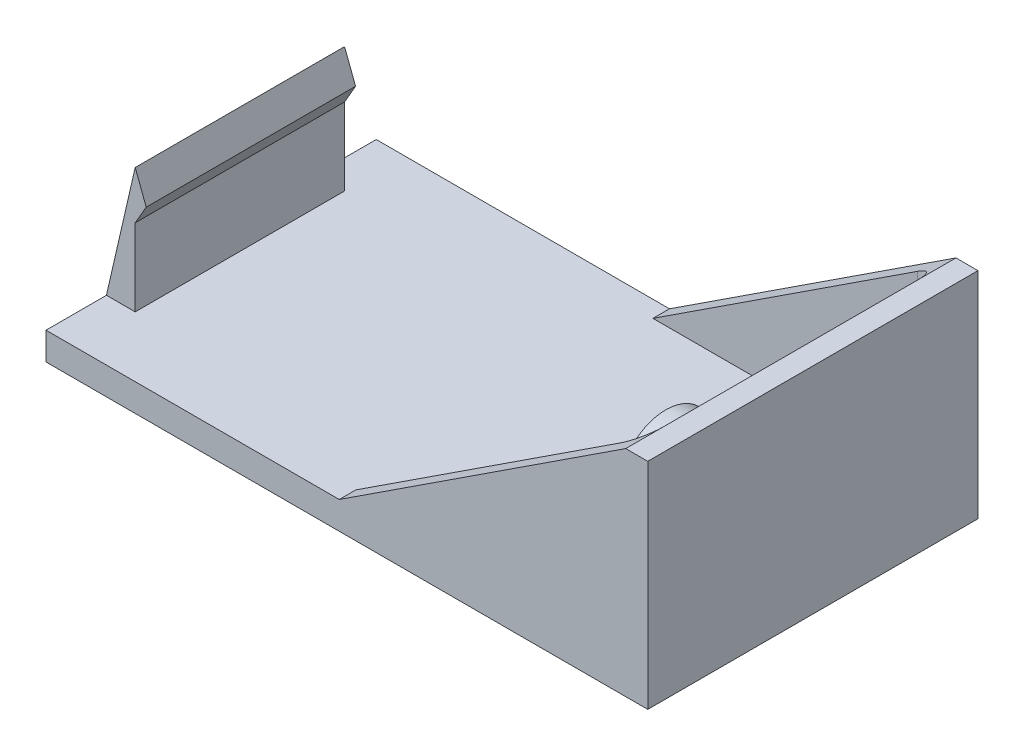
ISO-10303-21;
HEADER;
FILE_DESCRIPTION(('STEP AP214'),'2;1');
FILE_NAME('part.step','',(''),(''),'','','');
FILE_SCHEMA(('AUTOMOTIVE_DESIGN { 1 0 10303 214 1 1 1 1 }'));
ENDSEC;
DATA;
#1=APPLICATION_CONTEXT('core data for automotive mechanical design processes');
#2=APPLICATION_PROTOCOL_DEFINITION('international standard','automotive_design',2000,#1);
#3=PRODUCT_CONTEXT('',#1,'mechanical');
#4=PRODUCT('Part','Part','',(#3));
#5=PRODUCT_RELATED_PRODUCT_CATEGORY('part','',(#4));
#6=PRODUCT_DEFINITION_FORMATION('','',#4);
#7=PRODUCT_DEFINITION_CONTEXT('part definition',#1,'design');
#8=PRODUCT_DEFINITION('design','',#6,#7);
#9=PRODUCT_DEFINITION_SHAPE('','',#8);
#10=(LENGTH_UNIT() NAMED_UNIT(*) SI_UNIT(.MILLI.,.METRE.));
#11=(NAMED_UNIT(*) PLANE_ANGLE_UNIT() SI_UNIT($,.RADIAN.));
#12=(NAMED_UNIT(*) SI_UNIT($,.STERADIAN.) SOLID_ANGLE_UNIT());
#13=UNCERTAINTY_MEASURE_WITH_UNIT(LENGTH_MEASURE(1.E-05),#10,'distance_accuracy_value','');
#14=(GEOMETRIC_REPRESENTATION_CONTEXT(3) GLOBAL_UNCERTAINTY_ASSIGNED_CONTEXT((#13)) GLOBAL_UNIT_ASSIGNED_CONTEXT((#10,
#11,#12)) REPRESENTATION_CONTEXT('',''));
#15=CARTESIAN_POINT('',(0.,0.,0.));
#16=DIRECTION('',(0.,0.,1.));
#17=DIRECTION('',(1.,0.,0.));
#18=AXIS2_PLACEMENT_3D('',#15,#16,#17);
#19=CARTESIAN_POINT('',(24.305,11.48,-6.34999999999999));
#20=DIRECTION('',(-1.,0.,0.));
#21=DIRECTION('',(0.,0.,1.));
#22=AXIS2_PLACEMENT_3D('',#19,#20,#21);
#23=PLANE('',#22);
#24=CARTESIAN_POINT('',(24.305,11.48,-6.34999999999999));
#25=DIRECTION('',(-1.,0.,0.));
#26=DIRECTION('',(0.,0.,1.));
#27=AXIS2_PLACEMENT_3D('',#24,#25,#26);
#28=CIRCLE('',#27,3.75);
#29=CARTESIAN_POINT('',(24.305,11.48,-2.59999999999999));
#30=VERTEX_POINT('',#29);
#31=EDGE_CURVE('E165',#30,#30,#28,.T.);
#32=ORIENTED_EDGE('',*,*,#31,.T.);
#33=EDGE_LOOP('',(#32));
#34=FACE_BOUND('',#33,.T.);
#35=CARTESIAN_POINT('',(24.305,11.48,-6.34999999999999));
#36=DIRECTION('',(-1.,0.,0.));
#37=DIRECTION('',(0.,0.,1.));
#38=AXIS2_PLACEMENT_3D('',#35,#36,#37);
#39=CIRCLE('',#38,3.);
#40=CARTESIAN_POINT('',(24.305,11.48,-3.34999999999999));
#41=VERTEX_POINT('',#40);
#42=EDGE_CURVE('E295',#41,#41,#39,.T.);
#43=ORIENTED_EDGE('',*,*,#42,.F.);
#44=EDGE_LOOP('',(#43));
#45=FACE_BOUND('',#44,.T.);
#46=ADVANCED_FACE('F33',(#34,#45),#23,.T.);
#47=CARTESIAN_POINT('',(25.305,19.5,11.485));
#48=DIRECTION('',(1.,0.,0.));
#49=DIRECTION('',(0.,0.,-1.));
#50=AXIS2_PLACEMENT_3D('',#47,#48,#49);
#51=PLANE('',#50);
#52=DIRECTION('',(0.,0.,1.));
#53=VECTOR('',#52,1.);
#54=CARTESIAN_POINT('',(25.305,2.5,11.485));
#55=LINE('',#54,#53);
#56=CARTESIAN_POINT('',(25.305,2.5,-11.485));
#57=VERTEX_POINT('',#56);
#58=CARTESIAN_POINT('',(25.305,2.5,11.485));
#59=VERTEX_POINT('',#58);
#60=EDGE_CURVE('E233',#57,#59,#55,.T.);
#61=ORIENTED_EDGE('',*,*,#60,.T.);
#62=DIRECTION('',(0.,-1.,0.));
#63=VECTOR('',#62,1.);
#64=CARTESIAN_POINT('',(25.305,19.5,11.485));
#65=LINE('',#64,#63);
#66=CARTESIAN_POINT('',(25.305,19.5,11.485));
#67=VERTEX_POINT('',#66);
#68=EDGE_CURVE('E667',#67,#59,#65,.T.);
#69=ORIENTED_EDGE('',*,*,#68,.F.);
#70=DIRECTION('',(0.,0.,1.));
#71=VECTOR('',#70,1.);
#72=CARTESIAN_POINT('',(25.305,19.5,11.485));
#73=LINE('',#72,#71);
#74=CARTESIAN_POINT('',(25.305,19.5,-11.485));
#75=VERTEX_POINT('',#74);
#76=EDGE_CURVE('E221',#75,#67,#73,.T.);
#77=ORIENTED_EDGE('',*,*,#76,.F.);
#78=DIRECTION('',(0.,-1.,0.));
#79=VECTOR('',#78,1.);
#80=CARTESIAN_POINT('',(25.305,19.5,-11.485));
#81=LINE('',#80,#79);
#82=EDGE_CURVE('E669',#75,#57,#81,.T.);
#83=ORIENTED_EDGE('',*,*,#82,.T.);
#84=EDGE_LOOP('',(#61,#69,#77,#83));
#85=FACE_BOUND('',#84,.T.);
#86=CARTESIAN_POINT('',(25.305,11.48,-6.34999999999999));
#87=DIRECTION('',(1.,0.,0.));
#88=DIRECTION('',(0.,0.,-1.));
#89=AXIS2_PLACEMENT_3D('',#86,#87,#88);
#90=CIRCLE('',#89,3.75);
#91=CARTESIAN_POINT('',(25.305,11.48,-10.1));
#92=VERTEX_POINT('',#91);
#93=EDGE_CURVE('E257',#92,#92,#90,.F.);
#94=ORIENTED_EDGE('',*,*,#93,.F.);
#95=EDGE_LOOP('',(#94));
#96=FACE_BOUND('',#95,.T.);
#97=CARTESIAN_POINT('',(25.305,11.48,6.35000000000001));
#98=DIRECTION('',(1.,0.,0.));
#99=DIRECTION('',(0.,0.,-1.));
#100=AXIS2_PLACEMENT_3D('',#97,#98,#99);
#101=CIRCLE('',#100,3.75);
#102=CARTESIAN_POINT('',(25.305,11.48,2.60000000000001));
#103=VERTEX_POINT('',#102);
#104=EDGE_CURVE('E260',#103,#103,#101,.F.);
#105=ORIENTED_EDGE('',*,*,#104,.F.);
#106=EDGE_LOOP('',(#105));
#107=FACE_BOUND('',#106,.T.);
#108=ADVANCED_FACE('F284',(#85,#96,#107),#51,.F.);
#109=CARTESIAN_POINT('',(0.,2.5,0.));
#110=DIRECTION('',(0.,1.,0.));
#111=DIRECTION('',(0.,0.,1.));
#112=AXIS2_PLACEMENT_3D('',#109,#110,#111);
#113=PLANE('',#112);
#114=DIRECTION('',(0.,0.,1.));
#115=VECTOR('',#114,1.);
#116=CARTESIAN_POINT('',(-27.305,2.5,-14.985));
#117=LINE('',#116,#115);
#118=CARTESIAN_POINT('',(-27.305,2.5,-14.985));
#119=VERTEX_POINT('',#118);
#120=CARTESIAN_POINT('',(-27.305,2.5,-9.5));
#121=VERTEX_POINT('',#120);
#122=EDGE_CURVE('E655',#119,#121,#117,.T.);
#123=ORIENTED_EDGE('',*,*,#122,.T.);
#124=DIRECTION('',(1.,0.,0.));
#125=VECTOR('',#124,1.);
#126=CARTESIAN_POINT('',(-24.695,2.5,-9.5));
#127=LINE('',#126,#125);
#128=CARTESIAN_POINT('',(-24.695,2.5,-9.5));
#129=VERTEX_POINT('',#128);
#130=EDGE_CURVE('E48',#121,#129,#127,.T.);
#131=ORIENTED_EDGE('',*,*,#130,.T.);
#132=DIRECTION('',(0.,0.,1.));
#133=VECTOR('',#132,1.);
#134=CARTESIAN_POINT('',(-24.695,2.5,-9.5));
#135=LINE('',#134,#133);
#136=CARTESIAN_POINT('',(-24.695,2.5,9.5));
#137=VERTEX_POINT('',#136);
#138=EDGE_CURVE('E143',#129,#137,#135,.T.);
#139=ORIENTED_EDGE('',*,*,#138,.T.);
#140=DIRECTION('',(1.,0.,0.));
#141=VECTOR('',#140,1.);
#142=CARTESIAN_POINT('',(-24.695,2.5,9.5));
#143=LINE('',#142,#141);
#144=CARTESIAN_POINT('',(-27.305,2.5,9.49999999999999));
#145=VERTEX_POINT('',#144);
#146=EDGE_CURVE('E54',#145,#137,#143,.T.);
#147=ORIENTED_EDGE('',*,*,#146,.F.);
#148=CARTESIAN_POINT('',(-27.305,2.5,14.985));
#149=VERTEX_POINT('',#148);
#150=EDGE_CURVE('E640',#145,#149,#117,.T.);
#151=ORIENTED_EDGE('',*,*,#150,.T.);
#152=DIRECTION('',(1.,0.,0.));
#153=VECTOR('',#152,1.);
#154=CARTESIAN_POINT('',(-27.305,2.5,14.985));
#155=LINE('',#154,#153);
#156=CARTESIAN_POINT('',(-0.694999999999994,2.5,14.985));
#157=VERTEX_POINT('',#156);
#158=EDGE_CURVE('E632',#149,#157,#155,.T.);
#159=ORIENTED_EDGE('',*,*,#158,.T.);
#160=DIRECTION('',(0.,0.,1.));
#161=VECTOR('',#160,1.);
#162=CARTESIAN_POINT('',(-0.694999999999994,2.5,14.985));
#163=LINE('',#162,#161);
#164=CARTESIAN_POINT('',(-0.694999999999994,2.5,13.485));
#165=VERTEX_POINT('',#164);
#166=EDGE_CURVE('E218',#165,#157,#163,.T.);
#167=ORIENTED_EDGE('',*,*,#166,.F.);
#168=DIRECTION('',(-1.,0.,0.));
#169=VECTOR('',#168,1.);
#170=CARTESIAN_POINT('',(-0.694999999999994,2.5,13.485));
#171=LINE('',#170,#169);
#172=CARTESIAN_POINT('',(23.305,2.5,13.485));
#173=VERTEX_POINT('',#172);
#174=EDGE_CURVE('E239',#173,#165,#171,.T.);
#175=ORIENTED_EDGE('',*,*,#174,.F.);
#176=CARTESIAN_POINT('',(23.305,2.5,11.485));
#177=DIRECTION('',(0.,-1.,0.));
#178=DIRECTION('',(0.,0.,-1.));
#179=AXIS2_PLACEMENT_3D('',#176,#177,#178);
#180=CIRCLE('',#179,2.);
#181=EDGE_CURVE('E236',#59,#173,#180,.T.);
#182=ORIENTED_EDGE('',*,*,#181,.F.);
#183=ORIENTED_EDGE('',*,*,#60,.F.);
#184=CARTESIAN_POINT('',(23.305,2.5,-11.485));
#185=DIRECTION('',(0.,-1.,0.));
#186=DIRECTION('',(0.,0.,1.));
#187=AXIS2_PLACEMENT_3D('',#184,#185,#186);
#188=CIRCLE('',#187,2.);
#189=CARTESIAN_POINT('',(23.305,2.5,-13.485));
#190=VERTEX_POINT('',#189);
#191=EDGE_CURVE('E230',#190,#57,#188,.T.);
#192=ORIENTED_EDGE('',*,*,#191,.F.);
#193=DIRECTION('',(1.,0.,0.));
#194=VECTOR('',#193,1.);
#195=CARTESIAN_POINT('',(-0.694999999999967,2.5,-13.485));
#196=LINE('',#195,#194);
#197=CARTESIAN_POINT('',(-0.694999999999994,2.5,-13.485));
#198=VERTEX_POINT('',#197);
#199=EDGE_CURVE('E227',#198,#190,#196,.T.);
#200=ORIENTED_EDGE('',*,*,#199,.F.);
#201=DIRECTION('',(0.,0.,1.));
#202=VECTOR('',#201,1.);
#203=CARTESIAN_POINT('',(-0.694999999999967,2.5,-14.985));
#204=LINE('',#203,#202);
#205=CARTESIAN_POINT('',(-0.694999999999994,2.5,-14.9850225));
#206=VERTEX_POINT('',#205);
#207=EDGE_CURVE('E211',#206,#198,#204,.T.);
#208=ORIENTED_EDGE('',*,*,#207,.F.);
#209=DIRECTION('',(-1.,0.,0.));
#210=VECTOR('',#209,1.);
#211=CARTESIAN_POINT('',(-27.305,2.5,-14.985));
#212=LINE('',#211,#210);
#213=EDGE_CURVE('E638',#206,#119,#212,.T.);
#214=ORIENTED_EDGE('',*,*,#213,.T.);
#215=EDGE_LOOP('',(#123,#131,#139,#147,#151,#159,#167,#175,#182,#183,#192,#200,#208,#214));
#216=FACE_BOUND('',#215,.T.);
#217=ADVANCED_FACE('F145',(#216),#113,.T.);
#218=CARTESIAN_POINT('',(27.305,2.5,-14.985));
#219=DIRECTION('',(-1.,0.,0.));
#220=DIRECTION('',(0.,0.,1.));
#221=AXIS2_PLACEMENT_3D('',#218,#219,#220);
#222=PLANE('',#221);
#223=DIRECTION('',(0.,0.,-1.));
#224=VECTOR('',#223,1.);
#225=CARTESIAN_POINT('',(27.305,0.,-14.985));
#226=LINE('',#225,#224);
#227=CARTESIAN_POINT('',(27.305,0.,14.985));
#228=VERTEX_POINT('',#227);
#229=CARTESIAN_POINT('',(27.305,0.,-14.985));
#230=VERTEX_POINT('',#229);
#231=EDGE_CURVE('E637',#228,#230,#226,.T.);
#232=ORIENTED_EDGE('',*,*,#231,.T.);
#233=DIRECTION('',(0.,-1.,0.));
#234=VECTOR('',#233,1.);
#235=CARTESIAN_POINT('',(27.305,2.5,-14.985));
#236=LINE('',#235,#234);
#237=CARTESIAN_POINT('',(27.305,19.5,-14.985));
#238=VERTEX_POINT('',#237);
#239=EDGE_CURVE('E253',#238,#230,#236,.T.);
#240=ORIENTED_EDGE('',*,*,#239,.F.);
#241=DIRECTION('',(0.,0.,-1.));
#242=VECTOR('',#241,1.);
#243=CARTESIAN_POINT('',(27.305,19.5,14.985));
#244=LINE('',#243,#242);
#245=CARTESIAN_POINT('',(27.305,19.5,14.985));
#246=VERTEX_POINT('',#245);
#247=EDGE_CURVE('E214',#246,#238,#244,.T.);
#248=ORIENTED_EDGE('',*,*,#247,.F.);
#249=DIRECTION('',(0.,-1.,0.));
#250=VECTOR('',#249,1.);
#251=CARTESIAN_POINT('',(27.305,2.5,14.985));
#252=LINE('',#251,#250);
#253=EDGE_CURVE('E633',#246,#228,#252,.T.);
#254=ORIENTED_EDGE('',*,*,#253,.T.);
#255=EDGE_LOOP('',(#232,#240,#248,#254));
#256=FACE_BOUND('',#255,.T.);
#257=ADVANCED_FACE('F35',(#256),#222,.F.);
#258=CARTESIAN_POINT('',(-27.305,2.5,-14.985));
#259=DIRECTION('',(0.,0.,1.));
#260=DIRECTION('',(1.,0.,0.));
#261=AXIS2_PLACEMENT_3D('',#258,#259,#260);
#262=PLANE('',#261);
#263=ORIENTED_EDGE('',*,*,#213,.F.);
#264=DIRECTION('',(0.836969613973546,0.547249362982703,0.));
#265=VECTOR('',#264,1.);
#266=CARTESIAN_POINT('',(-19.3357875647668,-9.68820725388601,-14.985));
#267=LINE('',#266,#265);
#268=CARTESIAN_POINT('',(25.305,19.5,-14.985));
#269=VERTEX_POINT('',#268);
#270=EDGE_CURVE('E208',#206,#269,#267,.T.);
#271=ORIENTED_EDGE('',*,*,#270,.T.);
#272=DIRECTION('',(-1.,0.,0.));
#273=VECTOR('',#272,1.);
#274=CARTESIAN_POINT('',(27.305,19.5,-14.985));
#275=LINE('',#274,#273);
#276=EDGE_CURVE('E217',#238,#269,#275,.T.);
#277=ORIENTED_EDGE('',*,*,#276,.F.);
#278=ORIENTED_EDGE('',*,*,#239,.T.);
#279=DIRECTION('',(-1.,0.,0.));
#280=VECTOR('',#279,1.);
#281=CARTESIAN_POINT('',(-27.305,0.,-14.985));
#282=LINE('',#281,#280);
#283=CARTESIAN_POINT('',(-27.305,0.,-14.985));
#284=VERTEX_POINT('',#283);
#285=EDGE_CURVE('E625',#230,#284,#282,.T.);
#286=ORIENTED_EDGE('',*,*,#285,.T.);
#287=DIRECTION('',(0.,-1.,0.));
#288=VECTOR('',#287,1.);
#289=CARTESIAN_POINT('',(-27.305,2.5,-14.985));
#290=LINE('',#289,#288);
#291=EDGE_CURVE('E622',#119,#284,#290,.T.);
#292=ORIENTED_EDGE('',*,*,#291,.F.);
#293=EDGE_LOOP('',(#263,#271,#277,#278,#286,#292));
#294=FACE_BOUND('',#293,.T.);
#295=ADVANCED_FACE('F560',(#294),#262,.F.);
#296=CARTESIAN_POINT('',(-27.305,2.5,-14.985));
#297=DIRECTION('',(1.,0.,0.));
#298=DIRECTION('',(0.,0.,-1.));
#299=AXIS2_PLACEMENT_3D('',#296,#297,#298);
#300=PLANE('',#299);
#301=DIRECTION('',(0.,0.,1.));
#302=VECTOR('',#301,1.);
#303=CARTESIAN_POINT('',(-27.305,0.,-14.985));
#304=LINE('',#303,#302);
#305=CARTESIAN_POINT('',(-27.305,0.,14.985));
#306=VERTEX_POINT('',#305);
#307=EDGE_CURVE('E616',#284,#306,#304,.T.);
#308=ORIENTED_EDGE('',*,*,#307,.T.);
#309=DIRECTION('',(0.,-1.,0.));
#310=VECTOR('',#309,1.);
#311=CARTESIAN_POINT('',(-27.305,2.5,14.985));
#312=LINE('',#311,#310);
#313=EDGE_CURVE('E618',#149,#306,#312,.T.);
#314=ORIENTED_EDGE('',*,*,#313,.F.);
#315=ORIENTED_EDGE('',*,*,#150,.F.);
#316=DIRECTION('',(0.,0.,1.));
#317=VECTOR('',#316,1.);
#318=CARTESIAN_POINT('',(-27.305,2.5,-9.5));
#319=LINE('',#318,#317);
#320=EDGE_CURVE('E187',#121,#145,#319,.T.);
#321=ORIENTED_EDGE('',*,*,#320,.F.);
#322=ORIENTED_EDGE('',*,*,#122,.F.);
#323=ORIENTED_EDGE('',*,*,#291,.T.);
#324=EDGE_LOOP('',(#308,#314,#315,#321,#322,#323));
#325=FACE_BOUND('',#324,.T.);
#326=ADVANCED_FACE('F551',(#325),#300,.F.);
#327=CARTESIAN_POINT('',(-27.305,2.5,14.985));
#328=DIRECTION('',(0.,0.,-1.));
#329=DIRECTION('',(-1.,0.,0.));
#330=AXIS2_PLACEMENT_3D('',#327,#328,#329);
#331=PLANE('',#330);
#332=DIRECTION('',(1.,0.,0.));
#333=VECTOR('',#332,1.);
#334=CARTESIAN_POINT('',(27.305,19.5,14.985));
#335=LINE('',#334,#333);
#336=CARTESIAN_POINT('',(25.305,19.5,14.985));
#337=VERTEX_POINT('',#336);
#338=EDGE_CURVE('E224',#337,#246,#335,.T.);
#339=ORIENTED_EDGE('',*,*,#338,.F.);
#340=DIRECTION('',(0.836969613973546,0.547249362982703,0.));
#341=VECTOR('',#340,1.);
#342=CARTESIAN_POINT('',(-0.694999999999994,2.5,14.985));
#343=LINE('',#342,#341);
#344=EDGE_CURVE('E190',#157,#337,#343,.T.);
#345=ORIENTED_EDGE('',*,*,#344,.F.);
#346=ORIENTED_EDGE('',*,*,#158,.F.);
#347=ORIENTED_EDGE('',*,*,#313,.T.);
#348=DIRECTION('',(1.,0.,0.));
#349=VECTOR('',#348,1.);
#350=CARTESIAN_POINT('',(-27.305,0.,14.985));
#351=LINE('',#350,#349);
#352=EDGE_CURVE('E624',#306,#228,#351,.T.);
#353=ORIENTED_EDGE('',*,*,#352,.T.);
#354=ORIENTED_EDGE('',*,*,#253,.F.);
#355=EDGE_LOOP('',(#339,#345,#346,#347,#353,#354));
#356=FACE_BOUND('',#355,.T.);
#357=ADVANCED_FACE('F545',(#356),#331,.F.);
#358=CARTESIAN_POINT('',(0.,0.,0.));
#359=DIRECTION('',(0.,1.,0.));
#360=DIRECTION('',(0.,0.,1.));
#361=AXIS2_PLACEMENT_3D('',#358,#359,#360);
#362=PLANE('',#361);
#363=ORIENTED_EDGE('',*,*,#231,.F.);
#364=ORIENTED_EDGE('',*,*,#352,.F.);
#365=ORIENTED_EDGE('',*,*,#307,.F.);
#366=ORIENTED_EDGE('',*,*,#285,.F.);
#367=EDGE_LOOP('',(#363,#364,#365,#366));
#368=FACE_BOUND('',#367,.T.);
#369=ADVANCED_FACE('F540',(#368),#362,.F.);
#370=CARTESIAN_POINT('',(-0.694999999999967,19.5,-13.485));
#371=DIRECTION('',(0.,0.,-1.));
#372=DIRECTION('',(-1.,0.,0.));
#373=AXIS2_PLACEMENT_3D('',#370,#371,#372);
#374=PLANE('',#373);
#375=DIRECTION('',(0.,-1.,0.));
#376=VECTOR('',#375,1.);
#377=CARTESIAN_POINT('',(23.305,19.5,-13.485));
#378=LINE('',#377,#376);
#379=CARTESIAN_POINT('',(23.305,18.1923076923077,-13.485));
#380=VERTEX_POINT('',#379);
#381=EDGE_CURVE('E653',#380,#190,#378,.T.);
#382=ORIENTED_EDGE('',*,*,#381,.F.);
#383=DIRECTION('',(-0.836969613973546,-0.547249362982703,0.));
#384=VECTOR('',#383,1.);
#385=CARTESIAN_POINT('',(7.09152849740935,7.59119170984457,-13.485));
#386=LINE('',#385,#384);
#387=EDGE_CURVE('E205',#380,#198,#386,.T.);
#388=ORIENTED_EDGE('',*,*,#387,.T.);
#389=ORIENTED_EDGE('',*,*,#199,.T.);
#390=EDGE_LOOP('',(#382,#388,#389));
#391=FACE_BOUND('',#390,.T.);
#392=ADVANCED_FACE('F531',(#391),#374,.F.);
#393=CARTESIAN_POINT('',(23.305,19.5,-11.485));
#394=DIRECTION('',(0.,-1.,0.));
#395=DIRECTION('',(0.,0.,-1.));
#396=AXIS2_PLACEMENT_3D('',#393,#394,#395);
#397=CYLINDRICAL_SURFACE('',#396,2.);
#398=ORIENTED_EDGE('',*,*,#82,.F.);
#399=CARTESIAN_POINT('',(23.305,18.1923076923077,-11.485));
#400=DIRECTION('',(0.547249362982703,-0.836969613973546,0.));
#401=DIRECTION('',(-0.836969613973546,-0.547249362982703,0.));
#402=AXIS2_PLACEMENT_3D('',#399,#400,#401);
#403=ELLIPSE('',#402,2.38957301030909,2.);
#404=EDGE_CURVE('E202',#75,#380,#403,.F.);
#405=ORIENTED_EDGE('',*,*,#404,.T.);
#406=ORIENTED_EDGE('',*,*,#381,.T.);
#407=ORIENTED_EDGE('',*,*,#191,.T.);
#408=EDGE_LOOP('',(#398,#405,#406,#407));
#409=FACE_BOUND('',#408,.T.);
#410=ADVANCED_FACE('F522',(#409),#397,.F.);
#411=CARTESIAN_POINT('',(23.305,19.5,11.485));
#412=DIRECTION('',(0.,-1.,0.));
#413=DIRECTION('',(0.,0.,-1.));
#414=AXIS2_PLACEMENT_3D('',#411,#412,#413);
#415=CYLINDRICAL_SURFACE('',#414,2.);
#416=DIRECTION('',(0.,-1.,0.));
#417=VECTOR('',#416,1.);
#418=CARTESIAN_POINT('',(23.305,19.5,13.485));
#419=LINE('',#418,#417);
#420=CARTESIAN_POINT('',(23.305,18.1923076923077,13.485));
#421=VERTEX_POINT('',#420);
#422=EDGE_CURVE('E226',#421,#173,#419,.T.);
#423=ORIENTED_EDGE('',*,*,#422,.F.);
#424=CARTESIAN_POINT('',(23.305,18.1923076923077,11.485));
#425=DIRECTION('',(0.547249362982703,-0.836969613973546,0.));
#426=DIRECTION('',(-0.836969613973546,-0.547249362982703,0.));
#427=AXIS2_PLACEMENT_3D('',#424,#425,#426);
#428=ELLIPSE('',#427,2.38957301030909,2.);
#429=EDGE_CURVE('E199',#421,#67,#428,.F.);
#430=ORIENTED_EDGE('',*,*,#429,.T.);
#431=ORIENTED_EDGE('',*,*,#68,.T.);
#432=ORIENTED_EDGE('',*,*,#181,.T.);
#433=EDGE_LOOP('',(#423,#430,#431,#432));
#434=FACE_BOUND('',#433,.T.);
#435=ADVANCED_FACE('F513',(#434),#415,.F.);
#436=CARTESIAN_POINT('',(-0.694999999999994,19.5,13.485));
#437=DIRECTION('',(0.,0.,1.));
#438=DIRECTION('',(1.,0.,0.));
#439=AXIS2_PLACEMENT_3D('',#436,#437,#438);
#440=PLANE('',#439);
#441=ORIENTED_EDGE('',*,*,#174,.T.);
#442=DIRECTION('',(0.836969613973546,0.547249362982703,0.));
#443=VECTOR('',#442,1.);
#444=CARTESIAN_POINT('',(7.09152849740933,7.59119170984456,13.485));
#445=LINE('',#444,#443);
#446=EDGE_CURVE('E196',#165,#421,#445,.T.);
#447=ORIENTED_EDGE('',*,*,#446,.T.);
#448=ORIENTED_EDGE('',*,*,#422,.T.);
#449=EDGE_LOOP('',(#441,#447,#448));
#450=FACE_BOUND('',#449,.T.);
#451=ADVANCED_FACE('F504',(#450),#440,.F.);
#452=CARTESIAN_POINT('',(23.305,19.5,-11.485));
#453=DIRECTION('',(0.,1.,0.));
#454=DIRECTION('',(0.,0.,1.));
#455=AXIS2_PLACEMENT_3D('',#452,#453,#454);
#456=PLANE('',#455);
#457=DIRECTION('',(0.,0.,-1.));
#458=VECTOR('',#457,1.);
#459=CARTESIAN_POINT('',(25.305,19.5,-11.485));
#460=LINE('',#459,#458);
#461=EDGE_CURVE('E252',#337,#67,#460,.T.);
#462=ORIENTED_EDGE('',*,*,#461,.F.);
#463=ORIENTED_EDGE('',*,*,#338,.T.);
#464=ORIENTED_EDGE('',*,*,#247,.T.);
#465=ORIENTED_EDGE('',*,*,#276,.T.);
#466=EDGE_CURVE('E250',#75,#269,#460,.T.);
#467=ORIENTED_EDGE('',*,*,#466,.F.);
#468=ORIENTED_EDGE('',*,*,#76,.T.);
#469=EDGE_LOOP('',(#462,#463,#464,#465,#467,#468));
#470=FACE_BOUND('',#469,.T.);
#471=ADVANCED_FACE('F496',(#470),#456,.T.);
#472=CARTESIAN_POINT('',(-0.694999999999994,2.5,-14.98505));
#473=DIRECTION('',(0.547249362982703,-0.836969613973546,0.));
#474=DIRECTION('',(0.836969613973546,0.547249362982703,0.));
#475=AXIS2_PLACEMENT_3D('',#472,#473,#474);
#476=PLANE('',#475);
#477=ORIENTED_EDGE('',*,*,#207,.T.);
#478=ORIENTED_EDGE('',*,*,#387,.F.);
#479=ORIENTED_EDGE('',*,*,#404,.F.);
#480=ORIENTED_EDGE('',*,*,#466,.T.);
#481=ORIENTED_EDGE('',*,*,#270,.F.);
#482=EDGE_LOOP('',(#477,#478,#479,#480,#481));
#483=FACE_BOUND('',#482,.T.);
#484=ADVANCED_FACE('F487',(#483),#476,.F.);
#485=ORIENTED_EDGE('',*,*,#446,.F.);
#486=ORIENTED_EDGE('',*,*,#166,.T.);
#487=ORIENTED_EDGE('',*,*,#344,.T.);
#488=ORIENTED_EDGE('',*,*,#461,.T.);
#489=ORIENTED_EDGE('',*,*,#429,.F.);
#490=EDGE_LOOP('',(#485,#486,#487,#488,#489));
#491=FACE_BOUND('',#490,.T.);
#492=ADVANCED_FACE('F470',(#491),#476,.F.);
#493=CARTESIAN_POINT('',(-27.305,2.5,-9.5));
#494=DIRECTION('',(-0.97456456409099,0.224106917381276,0.));
#495=DIRECTION('',(-0.224106917381276,-0.97456456409099,0.));
#496=AXIS2_PLACEMENT_3D('',#493,#494,#495);
#497=PLANE('',#496);
#498=ORIENTED_EDGE('',*,*,#320,.T.);
#499=DIRECTION('',(-0.224106917381276,-0.97456456409099,0.));
#500=VECTOR('',#499,1.);
#501=CARTESIAN_POINT('',(-27.305,2.5,9.5));
#502=LINE('',#501,#500);
#503=CARTESIAN_POINT('',(-24.695,13.85,9.5));
#504=VERTEX_POINT('',#503);
#505=EDGE_CURVE('E164',#504,#145,#502,.T.);
#506=ORIENTED_EDGE('',*,*,#505,.F.);
#507=DIRECTION('',(0.,0.,1.));
#508=VECTOR('',#507,1.);
#509=CARTESIAN_POINT('',(-24.695,13.85,-9.5));
#510=LINE('',#509,#508);
#511=CARTESIAN_POINT('',(-24.695,13.85,-9.5));
#512=VERTEX_POINT('',#511);
#513=EDGE_CURVE('E191',#512,#504,#510,.T.);
#514=ORIENTED_EDGE('',*,*,#513,.F.);
#515=DIRECTION('',(-0.224106917381276,-0.97456456409099,0.));
#516=VECTOR('',#515,1.);
#517=CARTESIAN_POINT('',(-27.305,2.5,-9.5));
#518=LINE('',#517,#516);
#519=EDGE_CURVE('E150',#512,#121,#518,.T.);
#520=ORIENTED_EDGE('',*,*,#519,.T.);
#521=EDGE_LOOP('',(#498,#506,#514,#520));
#522=FACE_BOUND('',#521,.T.);
#523=ADVANCED_FACE('F461',(#522),#497,.T.);
#524=CARTESIAN_POINT('',(-24.695,13.85,-9.5));
#525=DIRECTION('',(0.934168506392085,0.3568321757706,0.));
#526=DIRECTION('',(-0.3568321757706,0.934168506392085,0.));
#527=AXIS2_PLACEMENT_3D('',#524,#525,#526);
#528=PLANE('',#527);
#529=ORIENTED_EDGE('',*,*,#513,.T.);
#530=DIRECTION('',(-0.3568321757706,0.934168506392085,0.));
#531=VECTOR('',#530,1.);
#532=CARTESIAN_POINT('',(-24.695,13.85,9.5));
#533=LINE('',#532,#531);
#534=CARTESIAN_POINT('',(-23.695,11.2320508075689,9.5));
#535=VERTEX_POINT('',#534);
#536=EDGE_CURVE('E173',#535,#504,#533,.T.);
#537=ORIENTED_EDGE('',*,*,#536,.F.);
#538=DIRECTION('',(0.,0.,1.));
#539=VECTOR('',#538,1.);
#540=CARTESIAN_POINT('',(-23.695,11.2320508075689,-9.5));
#541=LINE('',#540,#539);
#542=CARTESIAN_POINT('',(-23.695,11.2320508075689,-9.5));
#543=VERTEX_POINT('',#542);
#544=EDGE_CURVE('E193',#543,#535,#541,.T.);
#545=ORIENTED_EDGE('',*,*,#544,.F.);
#546=DIRECTION('',(-0.3568321757706,0.934168506392085,0.));
#547=VECTOR('',#546,1.);
#548=CARTESIAN_POINT('',(-24.695,13.85,-9.5));
#549=LINE('',#548,#547);
#550=EDGE_CURVE('E182',#543,#512,#549,.T.);
#551=ORIENTED_EDGE('',*,*,#550,.T.);
#552=EDGE_LOOP('',(#529,#537,#545,#551));
#553=FACE_BOUND('',#552,.T.);
#554=ADVANCED_FACE('F452',(#553),#528,.T.);
#555=CARTESIAN_POINT('',(-23.695,11.2320508075689,-9.5));
#556=DIRECTION('',(0.866025403784439,-0.499999999999999,0.));
#557=DIRECTION('',(0.499999999999999,0.866025403784439,0.));
#558=AXIS2_PLACEMENT_3D('',#555,#556,#557);
#559=PLANE('',#558);
#560=ORIENTED_EDGE('',*,*,#544,.T.);
#561=DIRECTION('',(0.499999999999999,0.866025403784439,0.));
#562=VECTOR('',#561,1.);
#563=CARTESIAN_POINT('',(-23.695,11.2320508075689,9.5));
#564=LINE('',#563,#562);
#565=CARTESIAN_POINT('',(-24.695,9.5,9.5));
#566=VERTEX_POINT('',#565);
#567=EDGE_CURVE('E158',#566,#535,#564,.T.);
#568=ORIENTED_EDGE('',*,*,#567,.F.);
#569=DIRECTION('',(0.,0.,1.));
#570=VECTOR('',#569,1.);
#571=CARTESIAN_POINT('',(-24.695,9.5,-9.5));
#572=LINE('',#571,#570);
#573=CARTESIAN_POINT('',(-24.695,9.5,-9.5));
#574=VERTEX_POINT('',#573);
#575=EDGE_CURVE('E149',#574,#566,#572,.T.);
#576=ORIENTED_EDGE('',*,*,#575,.F.);
#577=DIRECTION('',(0.499999999999999,0.866025403784439,0.));
#578=VECTOR('',#577,1.);
#579=CARTESIAN_POINT('',(-23.695,11.2320508075689,-9.5));
#580=LINE('',#579,#578);
#581=EDGE_CURVE('E179',#574,#543,#580,.T.);
#582=ORIENTED_EDGE('',*,*,#581,.T.);
#583=EDGE_LOOP('',(#560,#568,#576,#582));
#584=FACE_BOUND('',#583,.T.);
#585=ADVANCED_FACE('F444',(#584),#559,.T.);
#586=CARTESIAN_POINT('',(-24.695,9.5,-9.5));
#587=DIRECTION('',(1.,0.,0.));
#588=DIRECTION('',(0.,0.,-1.));
#589=AXIS2_PLACEMENT_3D('',#586,#587,#588);
#590=PLANE('',#589);
#591=ORIENTED_EDGE('',*,*,#575,.T.);
#592=DIRECTION('',(0.,1.,0.));
#593=VECTOR('',#592,1.);
#594=CARTESIAN_POINT('',(-24.695,9.5,9.5));
#595=LINE('',#594,#593);
#596=EDGE_CURVE('E153',#137,#566,#595,.T.);
#597=ORIENTED_EDGE('',*,*,#596,.F.);
#598=ORIENTED_EDGE('',*,*,#138,.F.);
#599=DIRECTION('',(0.,1.,0.));
#600=VECTOR('',#599,1.);
#601=CARTESIAN_POINT('',(-24.695,9.5,-9.5));
#602=LINE('',#601,#600);
#603=EDGE_CURVE('E177',#129,#574,#602,.T.);
#604=ORIENTED_EDGE('',*,*,#603,.T.);
#605=EDGE_LOOP('',(#591,#597,#598,#604));
#606=FACE_BOUND('',#605,.T.);
#607=ADVANCED_FACE('F154',(#606),#590,.T.);
#608=CARTESIAN_POINT('',(0.,0.,-9.5));
#609=DIRECTION('',(0.,0.,1.));
#610=DIRECTION('',(1.,0.,0.));
#611=AXIS2_PLACEMENT_3D('',#608,#609,#610);
#612=PLANE('',#611);
#613=ORIENTED_EDGE('',*,*,#130,.F.);
#614=ORIENTED_EDGE('',*,*,#519,.F.);
#615=ORIENTED_EDGE('',*,*,#550,.F.);
#616=ORIENTED_EDGE('',*,*,#581,.F.);
#617=ORIENTED_EDGE('',*,*,#603,.F.);
#618=EDGE_LOOP('',(#613,#614,#615,#616,#617));
#619=FACE_BOUND('',#618,.T.);
#620=ADVANCED_FACE('F428',(#619),#612,.F.);
#621=CARTESIAN_POINT('',(0.,0.,9.5));
#622=DIRECTION('',(0.,0.,1.));
#623=DIRECTION('',(1.,0.,0.));
#624=AXIS2_PLACEMENT_3D('',#621,#622,#623);
#625=PLANE('',#624);
#626=ORIENTED_EDGE('',*,*,#146,.T.);
#627=ORIENTED_EDGE('',*,*,#596,.T.);
#628=ORIENTED_EDGE('',*,*,#567,.T.);
#629=ORIENTED_EDGE('',*,*,#536,.T.);
#630=ORIENTED_EDGE('',*,*,#505,.T.);
#631=EDGE_LOOP('',(#626,#627,#628,#629,#630));
#632=FACE_BOUND('',#631,.T.);
#633=ADVANCED_FACE('F161',(#632),#625,.T.);
#634=CARTESIAN_POINT('',(24.305,11.48,-6.34999999999999));
#635=DIRECTION('',(1.,0.,0.));
#636=DIRECTION('',(0.,0.,-1.));
#637=AXIS2_PLACEMENT_3D('',#634,#635,#636);
#638=CYLINDRICAL_SURFACE('',#637,3.75);
#639=ORIENTED_EDGE('',*,*,#31,.F.);
#640=EDGE_LOOP('',(#639));
#641=FACE_BOUND('',#640,.T.);
#642=ORIENTED_EDGE('',*,*,#93,.T.);
#643=EDGE_LOOP('',(#642));
#644=FACE_BOUND('',#643,.T.);
#645=ADVANCED_FACE('F313',(#641,#644),#638,.T.);
#646=CARTESIAN_POINT('',(24.305,11.48,6.35000000000001));
#647=DIRECTION('',(1.,0.,0.));
#648=DIRECTION('',(0.,0.,-1.));
#649=AXIS2_PLACEMENT_3D('',#646,#647,#648);
#650=CYLINDRICAL_SURFACE('',#649,3.75);
#651=CARTESIAN_POINT('',(24.305,11.48,6.35000000000001));
#652=DIRECTION('',(-1.,0.,0.));
#653=DIRECTION('',(0.,0.,1.));
#654=AXIS2_PLACEMENT_3D('',#651,#652,#653);
#655=CIRCLE('',#654,3.75);
#656=CARTESIAN_POINT('',(24.305,11.48,10.1));
#657=VERTEX_POINT('',#656);
#658=EDGE_CURVE('E168',#657,#657,#655,.T.);
#659=ORIENTED_EDGE('',*,*,#658,.F.);
#660=EDGE_LOOP('',(#659));
#661=FACE_BOUND('',#660,.T.);
#662=ORIENTED_EDGE('',*,*,#104,.T.);
#663=EDGE_LOOP('',(#662));
#664=FACE_BOUND('',#663,.T.);
#665=ADVANCED_FACE('F309',(#661,#664),#650,.T.);
#666=CARTESIAN_POINT('',(20.305,11.48,-6.34999999999999));
#667=DIRECTION('',(-1.,0.,0.));
#668=DIRECTION('',(0.,0.,1.));
#669=AXIS2_PLACEMENT_3D('',#666,#667,#668);
#670=PLANE('',#669);
#671=CARTESIAN_POINT('',(20.305,11.48,-6.34999999999999));
#672=DIRECTION('',(-1.,0.,0.));
#673=DIRECTION('',(0.,0.,1.));
#674=AXIS2_PLACEMENT_3D('',#671,#672,#673);
#675=CIRCLE('',#674,3.);
#676=CARTESIAN_POINT('',(20.305,11.48,-3.34999999999999));
#677=VERTEX_POINT('',#676);
#678=EDGE_CURVE('E297',#677,#677,#675,.T.);
#679=ORIENTED_EDGE('',*,*,#678,.T.);
#680=EDGE_LOOP('',(#679));
#681=FACE_BOUND('',#680,.T.);
#682=CARTESIAN_POINT('',(20.305,11.48,-6.34999999999999));
#683=DIRECTION('',(-1.,0.,0.));
#684=DIRECTION('',(0.,0.,1.));
#685=AXIS2_PLACEMENT_3D('',#682,#683,#684);
#686=CIRCLE('',#685,2.);
#687=CARTESIAN_POINT('',(20.305,11.48,-4.34999999999999));
#688=VERTEX_POINT('',#687);
#689=EDGE_CURVE('E298',#688,#688,#686,.T.);
#690=ORIENTED_EDGE('',*,*,#689,.F.);
#691=EDGE_LOOP('',(#690));
#692=FACE_BOUND('',#691,.T.);
#693=ADVANCED_FACE('F312',(#681,#692),#670,.T.);
#694=CARTESIAN_POINT('',(20.305,11.48,-6.34999999999999));
#695=DIRECTION('',(1.,0.,0.));
#696=DIRECTION('',(0.,0.,-1.));
#697=AXIS2_PLACEMENT_3D('',#694,#695,#696);
#698=CYLINDRICAL_SURFACE('',#697,3.);
#699=ORIENTED_EDGE('',*,*,#678,.F.);
#700=EDGE_LOOP('',(#699));
#701=FACE_BOUND('',#700,.T.);
#702=ORIENTED_EDGE('',*,*,#42,.T.);
#703=EDGE_LOOP('',(#702));
#704=FACE_BOUND('',#703,.T.);
#705=ADVANCED_FACE('F278',(#701,#704),#698,.T.);
#706=CARTESIAN_POINT('',(20.305,11.48,-6.34999999999999));
#707=DIRECTION('',(1.,0.,0.));
#708=DIRECTION('',(0.,0.,-1.));
#709=AXIS2_PLACEMENT_3D('',#706,#707,#708);
#710=CYLINDRICAL_SURFACE('',#709,2.);
#711=ORIENTED_EDGE('',*,*,#689,.T.);
#712=EDGE_LOOP('',(#711));
#713=FACE_BOUND('',#712,.T.);
#714=CARTESIAN_POINT('',(24.305,11.48,-6.34999999999999));
#715=DIRECTION('',(-1.,0.,0.));
#716=DIRECTION('',(0.,0.,1.));
#717=AXIS2_PLACEMENT_3D('',#714,#715,#716);
#718=CIRCLE('',#717,2.);
#719=CARTESIAN_POINT('',(24.305,11.48,-4.34999999999999));
#720=VERTEX_POINT('',#719);
#721=EDGE_CURVE('E41',#720,#720,#718,.F.);
#722=ORIENTED_EDGE('',*,*,#721,.T.);
#723=EDGE_LOOP('',(#722));
#724=FACE_BOUND('',#723,.T.);
#725=ADVANCED_FACE('F265',(#713,#724),#710,.F.);
#726=ORIENTED_EDGE('',*,*,#721,.F.);
#727=EDGE_LOOP('',(#726));
#728=FACE_BOUND('',#727,.T.);
#729=ADVANCED_FACE('F267',(#728),#23,.T.);
#730=CARTESIAN_POINT('',(24.305,11.48,6.35000000000001));
#731=DIRECTION('',(-1.,0.,0.));
#732=DIRECTION('',(0.,0.,1.));
#733=AXIS2_PLACEMENT_3D('',#730,#731,#732);
#734=PLANE('',#733);
#735=CARTESIAN_POINT('',(24.305,11.48,6.35000000000001));
#736=DIRECTION('',(-1.,0.,0.));
#737=DIRECTION('',(0.,0.,1.));
#738=AXIS2_PLACEMENT_3D('',#735,#736,#737);
#739=CIRCLE('',#738,4.25);
#740=CARTESIAN_POINT('',(24.305,11.48,10.6));
#741=VERTEX_POINT('',#740);
#742=EDGE_CURVE('E349',#741,#741,#739,.T.);
#743=ORIENTED_EDGE('',*,*,#742,.F.);
#744=EDGE_LOOP('',(#743));
#745=FACE_BOUND('',#744,.T.);
#746=ORIENTED_EDGE('',*,*,#658,.T.);
#747=EDGE_LOOP('',(#746));
#748=FACE_BOUND('',#747,.T.);
#749=ADVANCED_FACE('F269',(#745,#748),#734,.F.);
#750=CARTESIAN_POINT('',(20.305,11.48,6.35000000000001));
#751=DIRECTION('',(-1.,0.,0.));
#752=DIRECTION('',(0.,0.,1.));
#753=AXIS2_PLACEMENT_3D('',#750,#751,#752);
#754=PLANE('',#753);
#755=CARTESIAN_POINT('',(20.305,11.48,6.35000000000001));
#756=DIRECTION('',(-1.,0.,0.));
#757=DIRECTION('',(0.,0.,1.));
#758=AXIS2_PLACEMENT_3D('',#755,#756,#757);
#759=CIRCLE('',#758,4.25);
#760=CARTESIAN_POINT('',(20.305,11.48,10.6));
#761=VERTEX_POINT('',#760);
#762=EDGE_CURVE('E303',#761,#761,#759,.T.);
#763=ORIENTED_EDGE('',*,*,#762,.T.);
#764=EDGE_LOOP('',(#763));
#765=FACE_BOUND('',#764,.T.);
#766=CARTESIAN_POINT('',(20.305,11.48,6.35000000000001));
#767=DIRECTION('',(-1.,0.,0.));
#768=DIRECTION('',(0.,0.,1.));
#769=AXIS2_PLACEMENT_3D('',#766,#767,#768);
#770=CIRCLE('',#769,3.25);
#771=CARTESIAN_POINT('',(20.305,11.48,9.60000000000001));
#772=VERTEX_POINT('',#771);
#773=EDGE_CURVE('E346',#772,#772,#770,.T.);
#774=ORIENTED_EDGE('',*,*,#773,.F.);
#775=EDGE_LOOP('',(#774));
#776=FACE_BOUND('',#775,.T.);
#777=ADVANCED_FACE('F275',(#765,#776),#754,.T.);
#778=CARTESIAN_POINT('',(20.305,11.48,6.35000000000001));
#779=DIRECTION('',(1.,0.,0.));
#780=DIRECTION('',(0.,0.,-1.));
#781=AXIS2_PLACEMENT_3D('',#778,#779,#780);
#782=CYLINDRICAL_SURFACE('',#781,4.25);
#783=ORIENTED_EDGE('',*,*,#762,.F.);
#784=EDGE_LOOP('',(#783));
#785=FACE_BOUND('',#784,.T.);
#786=ORIENTED_EDGE('',*,*,#742,.T.);
#787=EDGE_LOOP('',(#786));
#788=FACE_BOUND('',#787,.T.);
#789=ADVANCED_FACE('F332',(#785,#788),#782,.T.);
#790=CARTESIAN_POINT('',(20.305,11.48,6.35000000000001));
#791=DIRECTION('',(1.,0.,0.));
#792=DIRECTION('',(0.,0.,-1.));
#793=AXIS2_PLACEMENT_3D('',#790,#791,#792);
#794=CYLINDRICAL_SURFACE('',#793,3.25);
#795=ORIENTED_EDGE('',*,*,#773,.T.);
#796=EDGE_LOOP('',(#795));
#797=FACE_BOUND('',#796,.T.);
#798=CARTESIAN_POINT('',(24.305,11.48,6.35000000000001));
#799=DIRECTION('',(-1.,0.,0.));
#800=DIRECTION('',(0.,0.,1.));
#801=AXIS2_PLACEMENT_3D('',#798,#799,#800);
#802=CIRCLE('',#801,3.25);
#803=CARTESIAN_POINT('',(24.305,11.48,9.60000000000001));
#804=VERTEX_POINT('',#803);
#805=EDGE_CURVE('E11',#804,#804,#802,.F.);
#806=ORIENTED_EDGE('',*,*,#805,.T.);
#807=EDGE_LOOP('',(#806));
#808=FACE_BOUND('',#807,.T.);
#809=ADVANCED_FACE('F327',(#797,#808),#794,.F.);
#810=CARTESIAN_POINT('',(24.305,11.48,6.35000000000001));
#811=DIRECTION('',(-1.,0.,0.));
#812=DIRECTION('',(0.,0.,1.));
#813=AXIS2_PLACEMENT_3D('',#810,#811,#812);
#814=PLANE('',#813);
#815=ORIENTED_EDGE('',*,*,#805,.F.);
#816=EDGE_LOOP('',(#815));
#817=FACE_BOUND('',#816,.T.);
#818=ADVANCED_FACE('F324',(#817),#814,.T.);
#819=CLOSED_SHELL('',(#46,#108,#217,#257,#295,#326,#357,#369,#392,#410,#435,#451,#471,#484,#492,
#523,#554,#585,#607,#620,#633,#645,#665,#693,#705,#725,#729,#749,#777,#789,#809,#818));
#820=MANIFOLD_SOLID_BREP('B2',#819);
#821=ADVANCED_BREP_SHAPE_REPRESENTATION('',(#18,#820),#14);
#822=SHAPE_DEFINITION_REPRESENTATION(#9,#821);
ENDSEC;
END-ISO-10303-21;
